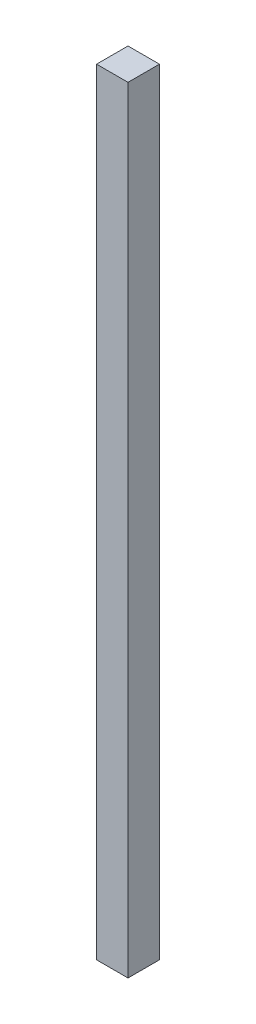
ISO-10303-21;
HEADER;
FILE_DESCRIPTION(('STEP AP214'),'2;1');
FILE_NAME('part.step','',(''),(''),'','','');
FILE_SCHEMA(('AUTOMOTIVE_DESIGN { 1 0 10303 214 1 1 1 1 }'));
ENDSEC;
DATA;
#1=APPLICATION_CONTEXT('core data for automotive mechanical design processes');
#2=APPLICATION_PROTOCOL_DEFINITION('international standard','automotive_design',2000,#1);
#3=PRODUCT_CONTEXT('',#1,'mechanical');
#4=PRODUCT('Part','Part','',(#3));
#5=PRODUCT_RELATED_PRODUCT_CATEGORY('part','',(#4));
#6=PRODUCT_DEFINITION_FORMATION('','',#4);
#7=PRODUCT_DEFINITION_CONTEXT('part definition',#1,'design');
#8=PRODUCT_DEFINITION('design','',#6,#7);
#9=PRODUCT_DEFINITION_SHAPE('','',#8);
#10=(LENGTH_UNIT() NAMED_UNIT(*) SI_UNIT(.MILLI.,.METRE.));
#11=(NAMED_UNIT(*) PLANE_ANGLE_UNIT() SI_UNIT($,.RADIAN.));
#12=(NAMED_UNIT(*) SI_UNIT($,.STERADIAN.) SOLID_ANGLE_UNIT());
#13=UNCERTAINTY_MEASURE_WITH_UNIT(LENGTH_MEASURE(1.E-05),#10,'distance_accuracy_value','');
#14=(GEOMETRIC_REPRESENTATION_CONTEXT(3) GLOBAL_UNCERTAINTY_ASSIGNED_CONTEXT((#13)) GLOBAL_UNIT_ASSIGNED_CONTEXT((#10,
#11,#12)) REPRESENTATION_CONTEXT('',''));
#15=CARTESIAN_POINT('',(0.,0.,0.));
#16=DIRECTION('',(0.,0.,1.));
#17=DIRECTION('',(1.,0.,0.));
#18=AXIS2_PLACEMENT_3D('',#15,#16,#17);
#19=CARTESIAN_POINT('',(-7.5,370.,-7.5));
#20=DIRECTION('',(1.,0.,0.));
#21=DIRECTION('',(0.,0.,-1.));
#22=AXIS2_PLACEMENT_3D('',#19,#20,#21);
#23=PLANE('',#22);
#24=DIRECTION('',(0.,0.,1.));
#25=VECTOR('',#24,1.);
#26=CARTESIAN_POINT('',(-7.5,0.,-7.5));
#27=LINE('',#26,#25);
#28=CARTESIAN_POINT('',(-7.5,0.,-7.5));
#29=VERTEX_POINT('',#28);
#30=CARTESIAN_POINT('',(-7.5,0.,7.5));
#31=VERTEX_POINT('',#30);
#32=EDGE_CURVE('E95',#29,#31,#27,.T.);
#33=ORIENTED_EDGE('',*,*,#32,.T.);
#34=DIRECTION('',(0.,-1.,0.));
#35=VECTOR('',#34,1.);
#36=CARTESIAN_POINT('',(-7.5,370.,7.5));
#37=LINE('',#36,#35);
#38=CARTESIAN_POINT('',(-7.5,370.,7.5));
#39=VERTEX_POINT('',#38);
#40=EDGE_CURVE('E11',#39,#31,#37,.T.);
#41=ORIENTED_EDGE('',*,*,#40,.F.);
#42=DIRECTION('',(0.,0.,1.));
#43=VECTOR('',#42,1.);
#44=CARTESIAN_POINT('',(-7.5,370.,-7.5));
#45=LINE('',#44,#43);
#46=CARTESIAN_POINT('',(-7.5,370.,-7.5));
#47=VERTEX_POINT('',#46);
#48=EDGE_CURVE('E83',#47,#39,#45,.T.);
#49=ORIENTED_EDGE('',*,*,#48,.F.);
#50=DIRECTION('',(0.,-1.,0.));
#51=VECTOR('',#50,1.);
#52=CARTESIAN_POINT('',(-7.5,370.,-7.5));
#53=LINE('',#52,#51);
#54=EDGE_CURVE('E91',#47,#29,#53,.T.);
#55=ORIENTED_EDGE('',*,*,#54,.T.);
#56=EDGE_LOOP('',(#33,#41,#49,#55));
#57=FACE_BOUND('',#56,.T.);
#58=ADVANCED_FACE('F32',(#57),#23,.F.);
#59=CARTESIAN_POINT('',(7.5,370.,7.5));
#60=DIRECTION('',(0.,0.,-1.));
#61=DIRECTION('',(-1.,0.,0.));
#62=AXIS2_PLACEMENT_3D('',#59,#60,#61);
#63=PLANE('',#62);
#64=DIRECTION('',(1.,0.,0.));
#65=VECTOR('',#64,1.);
#66=CARTESIAN_POINT('',(7.5,0.,7.5));
#67=LINE('',#66,#65);
#68=CARTESIAN_POINT('',(7.5,0.,7.5));
#69=VERTEX_POINT('',#68);
#70=EDGE_CURVE('E87',#31,#69,#67,.T.);
#71=ORIENTED_EDGE('',*,*,#70,.T.);
#72=DIRECTION('',(0.,-1.,0.));
#73=VECTOR('',#72,1.);
#74=CARTESIAN_POINT('',(7.5,370.,7.5));
#75=LINE('',#74,#73);
#76=CARTESIAN_POINT('',(7.5,370.,7.5));
#77=VERTEX_POINT('',#76);
#78=EDGE_CURVE('E40',#77,#69,#75,.T.);
#79=ORIENTED_EDGE('',*,*,#78,.F.);
#80=DIRECTION('',(1.,0.,0.));
#81=VECTOR('',#80,1.);
#82=CARTESIAN_POINT('',(7.5,370.,7.5));
#83=LINE('',#82,#81);
#84=EDGE_CURVE('E78',#39,#77,#83,.T.);
#85=ORIENTED_EDGE('',*,*,#84,.F.);
#86=ORIENTED_EDGE('',*,*,#40,.T.);
#87=EDGE_LOOP('',(#71,#79,#85,#86));
#88=FACE_BOUND('',#87,.T.);
#89=ADVANCED_FACE('F86',(#88),#63,.F.);
#90=CARTESIAN_POINT('',(7.5,370.,-7.5));
#91=DIRECTION('',(-1.,0.,0.));
#92=DIRECTION('',(0.,0.,1.));
#93=AXIS2_PLACEMENT_3D('',#90,#91,#92);
#94=PLANE('',#93);
#95=DIRECTION('',(0.,0.,-1.));
#96=VECTOR('',#95,1.);
#97=CARTESIAN_POINT('',(7.5,0.,-7.5));
#98=LINE('',#97,#96);
#99=CARTESIAN_POINT('',(7.5,0.,-7.5));
#100=VERTEX_POINT('',#99);
#101=EDGE_CURVE('E65',#69,#100,#98,.T.);
#102=ORIENTED_EDGE('',*,*,#101,.T.);
#103=DIRECTION('',(0.,-1.,0.));
#104=VECTOR('',#103,1.);
#105=CARTESIAN_POINT('',(7.5,370.,-7.5));
#106=LINE('',#105,#104);
#107=CARTESIAN_POINT('',(7.5,370.,-7.5));
#108=VERTEX_POINT('',#107);
#109=EDGE_CURVE('E88',#108,#100,#106,.T.);
#110=ORIENTED_EDGE('',*,*,#109,.F.);
#111=DIRECTION('',(0.,0.,-1.));
#112=VECTOR('',#111,1.);
#113=CARTESIAN_POINT('',(7.5,370.,-7.5));
#114=LINE('',#113,#112);
#115=EDGE_CURVE('E81',#77,#108,#114,.T.);
#116=ORIENTED_EDGE('',*,*,#115,.F.);
#117=ORIENTED_EDGE('',*,*,#78,.T.);
#118=EDGE_LOOP('',(#102,#110,#116,#117));
#119=FACE_BOUND('',#118,.T.);
#120=ADVANCED_FACE('F89',(#119),#94,.F.);
#121=CARTESIAN_POINT('',(7.5,370.,-7.5));
#122=DIRECTION('',(0.,0.,1.));
#123=DIRECTION('',(1.,0.,0.));
#124=AXIS2_PLACEMENT_3D('',#121,#122,#123);
#125=PLANE('',#124);
#126=DIRECTION('',(-1.,0.,0.));
#127=VECTOR('',#126,1.);
#128=CARTESIAN_POINT('',(7.5,0.,-7.5));
#129=LINE('',#128,#127);
#130=EDGE_CURVE('E71',#100,#29,#129,.T.);
#131=ORIENTED_EDGE('',*,*,#130,.T.);
#132=ORIENTED_EDGE('',*,*,#54,.F.);
#133=DIRECTION('',(-1.,0.,0.));
#134=VECTOR('',#133,1.);
#135=CARTESIAN_POINT('',(7.5,370.,-7.5));
#136=LINE('',#135,#134);
#137=EDGE_CURVE('E48',#108,#47,#136,.T.);
#138=ORIENTED_EDGE('',*,*,#137,.F.);
#139=ORIENTED_EDGE('',*,*,#109,.T.);
#140=EDGE_LOOP('',(#131,#132,#138,#139));
#141=FACE_BOUND('',#140,.T.);
#142=ADVANCED_FACE('F102',(#141),#125,.F.);
#143=CARTESIAN_POINT('',(0.,370.,0.));
#144=DIRECTION('',(0.,-1.,0.));
#145=DIRECTION('',(0.,0.,-1.));
#146=AXIS2_PLACEMENT_3D('',#143,#144,#145);
#147=PLANE('',#146);
#148=ORIENTED_EDGE('',*,*,#48,.T.);
#149=ORIENTED_EDGE('',*,*,#84,.T.);
#150=ORIENTED_EDGE('',*,*,#115,.T.);
#151=ORIENTED_EDGE('',*,*,#137,.T.);
#152=EDGE_LOOP('',(#148,#149,#150,#151));
#153=FACE_BOUND('',#152,.T.);
#154=ADVANCED_FACE('F79',(#153),#147,.F.);
#155=CARTESIAN_POINT('',(0.,0.,0.));
#156=DIRECTION('',(0.,-1.,0.));
#157=DIRECTION('',(0.,0.,-1.));
#158=AXIS2_PLACEMENT_3D('',#155,#156,#157);
#159=PLANE('',#158);
#160=ORIENTED_EDGE('',*,*,#32,.F.);
#161=ORIENTED_EDGE('',*,*,#130,.F.);
#162=ORIENTED_EDGE('',*,*,#101,.F.);
#163=ORIENTED_EDGE('',*,*,#70,.F.);
#164=EDGE_LOOP('',(#160,#161,#162,#163));
#165=FACE_BOUND('',#164,.T.);
#166=ADVANCED_FACE('F105',(#165),#159,.T.);
#167=CLOSED_SHELL('',(#58,#89,#120,#142,#154,#166));
#168=MANIFOLD_SOLID_BREP('B2',#167);
#169=ADVANCED_BREP_SHAPE_REPRESENTATION('',(#18,#168),#14);
#170=SHAPE_DEFINITION_REPRESENTATION(#9,#169);
ENDSEC;
END-ISO-10303-21;
